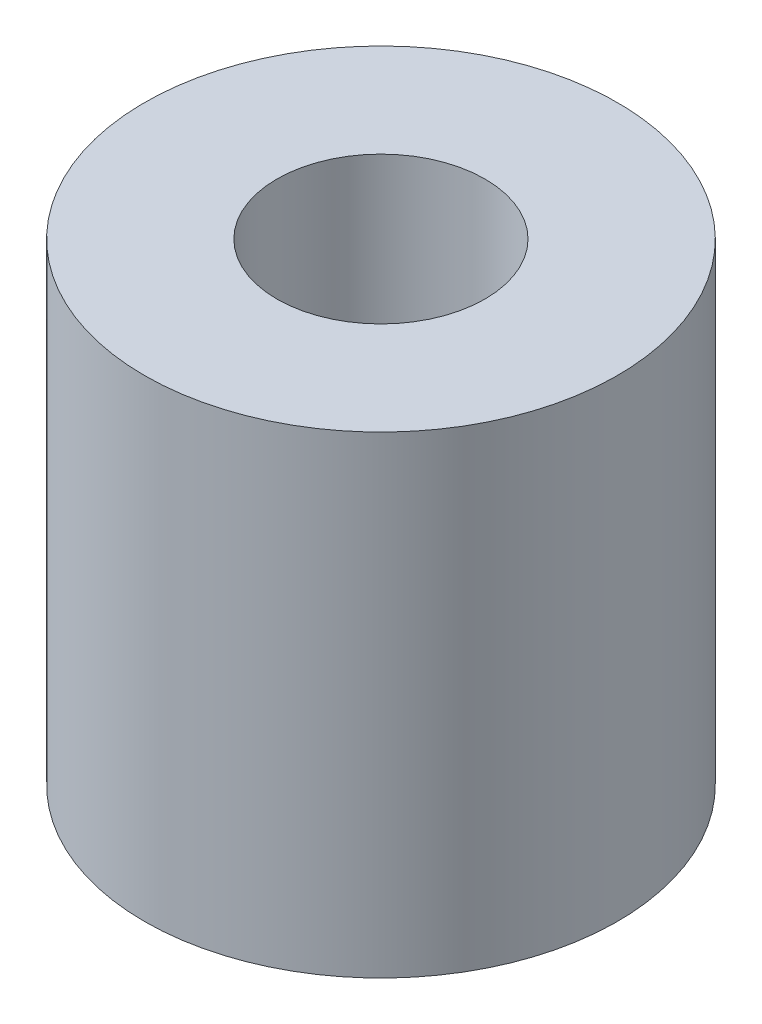
ISO-10303-21;
HEADER;
FILE_DESCRIPTION(('STEP AP214'),'2;1');
FILE_NAME('part.step','',(''),(''),'','','');
FILE_SCHEMA(('AUTOMOTIVE_DESIGN { 1 0 10303 214 1 1 1 1 }'));
ENDSEC;
DATA;
#1=APPLICATION_CONTEXT('core data for automotive mechanical design processes');
#2=APPLICATION_PROTOCOL_DEFINITION('international standard','automotive_design',2000,#1);
#3=PRODUCT_CONTEXT('',#1,'mechanical');
#4=PRODUCT('Part','Part','',(#3));
#5=PRODUCT_RELATED_PRODUCT_CATEGORY('part','',(#4));
#6=PRODUCT_DEFINITION_FORMATION('','',#4);
#7=PRODUCT_DEFINITION_CONTEXT('part definition',#1,'design');
#8=PRODUCT_DEFINITION('design','',#6,#7);
#9=PRODUCT_DEFINITION_SHAPE('','',#8);
#10=(LENGTH_UNIT() NAMED_UNIT(*) SI_UNIT(.MILLI.,.METRE.));
#11=(NAMED_UNIT(*) PLANE_ANGLE_UNIT() SI_UNIT($,.RADIAN.));
#12=(NAMED_UNIT(*) SI_UNIT($,.STERADIAN.) SOLID_ANGLE_UNIT());
#13=UNCERTAINTY_MEASURE_WITH_UNIT(LENGTH_MEASURE(1.E-05),#10,'distance_accuracy_value','');
#14=(GEOMETRIC_REPRESENTATION_CONTEXT(3) GLOBAL_UNCERTAINTY_ASSIGNED_CONTEXT((#13)) GLOBAL_UNIT_ASSIGNED_CONTEXT((#10,
#11,#12)) REPRESENTATION_CONTEXT('',''));
#15=CARTESIAN_POINT('',(0.,0.,0.));
#16=DIRECTION('',(0.,0.,1.));
#17=DIRECTION('',(1.,0.,0.));
#18=AXIS2_PLACEMENT_3D('',#15,#16,#17);
#19=CARTESIAN_POINT('',(0.,5.,0.));
#20=DIRECTION('',(0.,1.,0.));
#21=DIRECTION('',(0.,0.,1.));
#22=AXIS2_PLACEMENT_3D('',#19,#20,#21);
#23=PLANE('',#22);
#24=CARTESIAN_POINT('',(0.,5.,0.));
#25=DIRECTION('',(0.,1.,0.));
#26=DIRECTION('',(0.,0.,1.));
#27=AXIS2_PLACEMENT_3D('',#24,#25,#26);
#28=CIRCLE('',#27,2.5);
#29=CARTESIAN_POINT('',(0.,5.,2.5));
#30=VERTEX_POINT('',#29);
#31=EDGE_CURVE('E10',#30,#30,#28,.T.);
#32=ORIENTED_EDGE('',*,*,#31,.T.);
#33=EDGE_LOOP('',(#32));
#34=FACE_BOUND('',#33,.T.);
#35=CARTESIAN_POINT('',(0.,5.,0.));
#36=DIRECTION('',(0.,1.,0.));
#37=DIRECTION('',(0.,0.,1.));
#38=AXIS2_PLACEMENT_3D('',#35,#36,#37);
#39=CIRCLE('',#38,1.1);
#40=CARTESIAN_POINT('',(0.,5.,1.1));
#41=VERTEX_POINT('',#40);
#42=EDGE_CURVE('E43',#41,#41,#39,.T.);
#43=ORIENTED_EDGE('',*,*,#42,.F.);
#44=EDGE_LOOP('',(#43));
#45=FACE_BOUND('',#44,.T.);
#46=ADVANCED_FACE('F32',(#34,#45),#23,.T.);
#47=CARTESIAN_POINT('',(0.,0.,0.));
#48=DIRECTION('',(0.,1.,0.));
#49=DIRECTION('',(0.,0.,1.));
#50=AXIS2_PLACEMENT_3D('',#47,#48,#49);
#51=PLANE('',#50);
#52=CARTESIAN_POINT('',(0.,0.,0.));
#53=DIRECTION('',(0.,1.,0.));
#54=DIRECTION('',(0.,0.,1.));
#55=AXIS2_PLACEMENT_3D('',#52,#53,#54);
#56=CIRCLE('',#55,2.5);
#57=CARTESIAN_POINT('',(0.,0.,2.5));
#58=VERTEX_POINT('',#57);
#59=EDGE_CURVE('E36',#58,#58,#56,.T.);
#60=ORIENTED_EDGE('',*,*,#59,.F.);
#61=EDGE_LOOP('',(#60));
#62=FACE_BOUND('',#61,.T.);
#63=CARTESIAN_POINT('',(0.,0.,0.));
#64=DIRECTION('',(0.,1.,0.));
#65=DIRECTION('',(0.,0.,1.));
#66=AXIS2_PLACEMENT_3D('',#63,#64,#65);
#67=CIRCLE('',#66,1.1);
#68=CARTESIAN_POINT('',(0.,0.,1.1));
#69=VERTEX_POINT('',#68);
#70=EDGE_CURVE('E45',#69,#69,#67,.T.);
#71=ORIENTED_EDGE('',*,*,#70,.T.);
#72=EDGE_LOOP('',(#71));
#73=FACE_BOUND('',#72,.T.);
#74=ADVANCED_FACE('F55',(#62,#73),#51,.F.);
#75=CARTESIAN_POINT('',(0.,5.,0.));
#76=DIRECTION('',(0.,-1.,0.));
#77=DIRECTION('',(0.,0.,-1.));
#78=AXIS2_PLACEMENT_3D('',#75,#76,#77);
#79=CYLINDRICAL_SURFACE('',#78,2.5);
#80=ORIENTED_EDGE('',*,*,#31,.F.);
#81=EDGE_LOOP('',(#80));
#82=FACE_BOUND('',#81,.T.);
#83=ORIENTED_EDGE('',*,*,#59,.T.);
#84=EDGE_LOOP('',(#83));
#85=FACE_BOUND('',#84,.T.);
#86=ADVANCED_FACE('F34',(#82,#85),#79,.T.);
#87=CARTESIAN_POINT('',(0.,5.,0.));
#88=DIRECTION('',(0.,-1.,0.));
#89=DIRECTION('',(0.,0.,-1.));
#90=AXIS2_PLACEMENT_3D('',#87,#88,#89);
#91=CYLINDRICAL_SURFACE('',#90,1.1);
#92=ORIENTED_EDGE('',*,*,#42,.T.);
#93=EDGE_LOOP('',(#92));
#94=FACE_BOUND('',#93,.T.);
#95=ORIENTED_EDGE('',*,*,#70,.F.);
#96=EDGE_LOOP('',(#95));
#97=FACE_BOUND('',#96,.T.);
#98=ADVANCED_FACE('F51',(#94,#97),#91,.F.);
#99=CLOSED_SHELL('',(#46,#74,#86,#98));
#100=MANIFOLD_SOLID_BREP('B2',#99);
#101=ADVANCED_BREP_SHAPE_REPRESENTATION('',(#18,#100),#14);
#102=SHAPE_DEFINITION_REPRESENTATION(#9,#101);
ENDSEC;
END-ISO-10303-21;
